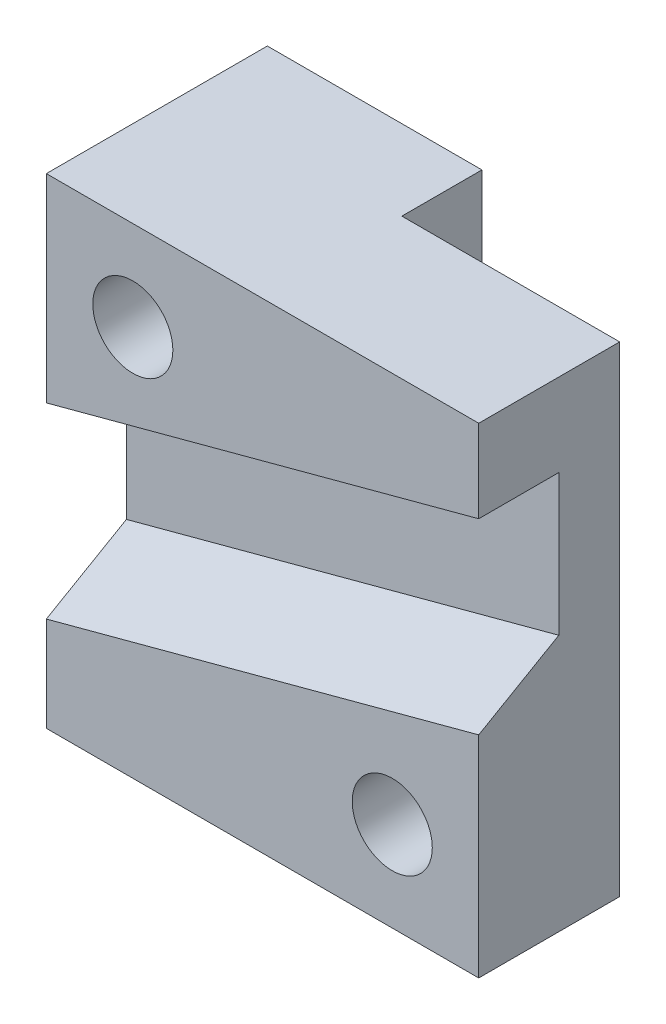
ISO-10303-21;
HEADER;
FILE_DESCRIPTION(('STEP AP214'),'2;1');
FILE_NAME('part.step','',(''),(''),'','','');
FILE_SCHEMA(('AUTOMOTIVE_DESIGN { 1 0 10303 214 1 1 1 1 }'));
ENDSEC;
DATA;
#1=APPLICATION_CONTEXT('core data for automotive mechanical design processes');
#2=APPLICATION_PROTOCOL_DEFINITION('international standard','automotive_design',2000,#1);
#3=PRODUCT_CONTEXT('',#1,'mechanical');
#4=PRODUCT('Part','Part','',(#3));
#5=PRODUCT_RELATED_PRODUCT_CATEGORY('part','',(#4));
#6=PRODUCT_DEFINITION_FORMATION('','',#4);
#7=PRODUCT_DEFINITION_CONTEXT('part definition',#1,'design');
#8=PRODUCT_DEFINITION('design','',#6,#7);
#9=PRODUCT_DEFINITION_SHAPE('','',#8);
#10=(LENGTH_UNIT() NAMED_UNIT(*) SI_UNIT(.MILLI.,.METRE.));
#11=(NAMED_UNIT(*) PLANE_ANGLE_UNIT() SI_UNIT($,.RADIAN.));
#12=(NAMED_UNIT(*) SI_UNIT($,.STERADIAN.) SOLID_ANGLE_UNIT());
#13=UNCERTAINTY_MEASURE_WITH_UNIT(LENGTH_MEASURE(1.E-05),#10,'distance_accuracy_value','');
#14=(GEOMETRIC_REPRESENTATION_CONTEXT(3) GLOBAL_UNCERTAINTY_ASSIGNED_CONTEXT((#13)) GLOBAL_UNIT_ASSIGNED_CONTEXT((#10,
#11,#12)) REPRESENTATION_CONTEXT('',''));
#15=CARTESIAN_POINT('',(0.,0.,0.));
#16=DIRECTION('',(0.,0.,1.));
#17=DIRECTION('',(1.,0.,0.));
#18=AXIS2_PLACEMENT_3D('',#15,#16,#17);
#19=CARTESIAN_POINT('',(0.,76.2,22.352));
#20=DIRECTION('',(0.,0.,-1.));
#21=DIRECTION('',(-1.,0.,0.));
#22=AXIS2_PLACEMENT_3D('',#19,#20,#21);
#23=PLANE('',#22);
#24=CARTESIAN_POINT('',(-13.716,14.224,22.352));
#25=DIRECTION('',(0.,0.,1.));
#26=DIRECTION('',(1.,0.,0.));
#27=AXIS2_PLACEMENT_3D('',#24,#25,#26);
#28=CIRCLE('',#27,6.35);
#29=CARTESIAN_POINT('',(-7.366,14.224,22.352));
#30=VERTEX_POINT('',#29);
#31=EDGE_CURVE('E231',#30,#30,#28,.T.);
#32=ORIENTED_EDGE('',*,*,#31,.F.);
#33=EDGE_LOOP('',(#32));
#34=FACE_BOUND('',#33,.T.);
#35=DIRECTION('',(0.,-1.,0.));
#36=VECTOR('',#35,1.);
#37=CARTESIAN_POINT('',(0.,76.2,22.352));
#38=LINE('',#37,#36);
#39=CARTESIAN_POINT('',(0.,33.3956071982183,22.352));
#40=VERTEX_POINT('',#39);
#41=CARTESIAN_POINT('',(0.,0.,22.352));
#42=VERTEX_POINT('',#41);
#43=EDGE_CURVE('E152',#40,#42,#38,.T.);
#44=ORIENTED_EDGE('',*,*,#43,.F.);
#45=DIRECTION('',(-0.965925826289068,-0.258819045102522,0.));
#46=VECTOR('',#45,1.);
#47=CARTESIAN_POINT('',(31.7369261955866,41.8994909425719,22.352));
#48=LINE('',#47,#46);
#49=CARTESIAN_POINT('',(-68.58,15.0196515812918,22.352));
#50=VERTEX_POINT('',#49);
#51=EDGE_CURVE('E175',#40,#50,#48,.T.);
#52=ORIENTED_EDGE('',*,*,#51,.T.);
#53=DIRECTION('',(0.,-1.,0.));
#54=VECTOR('',#53,1.);
#55=CARTESIAN_POINT('',(-68.58,76.2,22.352));
#56=LINE('',#55,#54);
#57=CARTESIAN_POINT('',(-68.58,0.,22.352));
#58=VERTEX_POINT('',#57);
#59=EDGE_CURVE('E125',#50,#58,#56,.T.);
#60=ORIENTED_EDGE('',*,*,#59,.T.);
#61=DIRECTION('',(1.,0.,0.));
#62=VECTOR('',#61,1.);
#63=CARTESIAN_POINT('',(0.,0.,22.352));
#64=LINE('',#63,#62);
#65=EDGE_CURVE('E146',#58,#42,#64,.T.);
#66=ORIENTED_EDGE('',*,*,#65,.T.);
#67=EDGE_LOOP('',(#44,#52,#60,#66));
#68=FACE_BOUND('',#67,.T.);
#69=ADVANCED_FACE('F33',(#34,#68),#23,.F.);
#70=CARTESIAN_POINT('',(-34.544,76.2,0.));
#71=DIRECTION('',(0.,0.,1.));
#72=DIRECTION('',(1.,0.,0.));
#73=AXIS2_PLACEMENT_3D('',#70,#71,#72);
#74=PLANE('',#73);
#75=CARTESIAN_POINT('',(-13.716,14.224,0.));
#76=DIRECTION('',(0.,0.,1.));
#77=DIRECTION('',(1.,0.,0.));
#78=AXIS2_PLACEMENT_3D('',#75,#76,#77);
#79=CIRCLE('',#78,6.35);
#80=CARTESIAN_POINT('',(-7.366,14.224,0.));
#81=VERTEX_POINT('',#80);
#82=EDGE_CURVE('E37',#81,#81,#79,.T.);
#83=ORIENTED_EDGE('',*,*,#82,.T.);
#84=EDGE_LOOP('',(#83));
#85=FACE_BOUND('',#84,.T.);
#86=DIRECTION('',(-1.,0.,0.));
#87=VECTOR('',#86,1.);
#88=CARTESIAN_POINT('',(-34.544,0.,0.));
#89=LINE('',#88,#87);
#90=CARTESIAN_POINT('',(0.,0.,0.));
#91=VERTEX_POINT('',#90);
#92=CARTESIAN_POINT('',(-34.544,0.,0.));
#93=VERTEX_POINT('',#92);
#94=EDGE_CURVE('E135',#91,#93,#89,.T.);
#95=ORIENTED_EDGE('',*,*,#94,.T.);
#96=DIRECTION('',(0.,-1.,0.));
#97=VECTOR('',#96,1.);
#98=CARTESIAN_POINT('',(-34.544,76.2,0.));
#99=LINE('',#98,#97);
#100=CARTESIAN_POINT('',(-34.544,76.2,0.));
#101=VERTEX_POINT('',#100);
#102=EDGE_CURVE('E11',#101,#93,#99,.T.);
#103=ORIENTED_EDGE('',*,*,#102,.F.);
#104=DIRECTION('',(-1.,0.,0.));
#105=VECTOR('',#104,1.);
#106=CARTESIAN_POINT('',(-34.544,76.2,0.));
#107=LINE('',#106,#105);
#108=CARTESIAN_POINT('',(0.,76.2,0.));
#109=VERTEX_POINT('',#108);
#110=EDGE_CURVE('E150',#109,#101,#107,.T.);
#111=ORIENTED_EDGE('',*,*,#110,.F.);
#112=DIRECTION('',(0.,-1.,0.));
#113=VECTOR('',#112,1.);
#114=CARTESIAN_POINT('',(0.,76.2,0.));
#115=LINE('',#114,#113);
#116=EDGE_CURVE('E131',#109,#91,#115,.T.);
#117=ORIENTED_EDGE('',*,*,#116,.T.);
#118=EDGE_LOOP('',(#95,#103,#111,#117));
#119=FACE_BOUND('',#118,.T.);
#120=ADVANCED_FACE('F35',(#85,#119),#74,.F.);
#121=CARTESIAN_POINT('',(-34.544,76.2,-12.7));
#122=DIRECTION('',(-1.,0.,0.));
#123=DIRECTION('',(0.,0.,1.));
#124=AXIS2_PLACEMENT_3D('',#121,#122,#123);
#125=PLANE('',#124);
#126=DIRECTION('',(0.,0.,-1.));
#127=VECTOR('',#126,1.);
#128=CARTESIAN_POINT('',(-34.544,0.,-12.7));
#129=LINE('',#128,#127);
#130=CARTESIAN_POINT('',(-34.544,0.,-12.7));
#131=VERTEX_POINT('',#130);
#132=EDGE_CURVE('E138',#93,#131,#129,.T.);
#133=ORIENTED_EDGE('',*,*,#132,.T.);
#134=DIRECTION('',(0.,-1.,0.));
#135=VECTOR('',#134,1.);
#136=CARTESIAN_POINT('',(-34.544,76.2,-12.7));
#137=LINE('',#136,#135);
#138=CARTESIAN_POINT('',(-34.544,76.2,-12.7));
#139=VERTEX_POINT('',#138);
#140=EDGE_CURVE('E42',#139,#131,#137,.T.);
#141=ORIENTED_EDGE('',*,*,#140,.F.);
#142=DIRECTION('',(0.,0.,-1.));
#143=VECTOR('',#142,1.);
#144=CARTESIAN_POINT('',(-34.544,76.2,-12.7));
#145=LINE('',#144,#143);
#146=EDGE_CURVE('E92',#101,#139,#145,.T.);
#147=ORIENTED_EDGE('',*,*,#146,.F.);
#148=ORIENTED_EDGE('',*,*,#102,.T.);
#149=EDGE_LOOP('',(#133,#141,#147,#148));
#150=FACE_BOUND('',#149,.T.);
#151=ADVANCED_FACE('F198',(#150),#125,.F.);
#152=CARTESIAN_POINT('',(-68.58,76.2,-12.7));
#153=DIRECTION('',(0.,0.,1.));
#154=DIRECTION('',(1.,0.,0.));
#155=AXIS2_PLACEMENT_3D('',#152,#153,#154);
#156=PLANE('',#155);
#157=CARTESIAN_POINT('',(-54.864,61.976,-12.7));
#158=DIRECTION('',(0.,0.,1.));
#159=DIRECTION('',(1.,0.,0.));
#160=AXIS2_PLACEMENT_3D('',#157,#158,#159);
#161=CIRCLE('',#160,6.35);
#162=CARTESIAN_POINT('',(-48.514,61.976,-12.7));
#163=VERTEX_POINT('',#162);
#164=EDGE_CURVE('E226',#163,#163,#161,.T.);
#165=ORIENTED_EDGE('',*,*,#164,.T.);
#166=EDGE_LOOP('',(#165));
#167=FACE_BOUND('',#166,.T.);
#168=DIRECTION('',(-1.,0.,0.));
#169=VECTOR('',#168,1.);
#170=CARTESIAN_POINT('',(-68.58,0.,-12.7));
#171=LINE('',#170,#169);
#172=CARTESIAN_POINT('',(-68.58,0.,-12.7));
#173=VERTEX_POINT('',#172);
#174=EDGE_CURVE('E141',#131,#173,#171,.T.);
#175=ORIENTED_EDGE('',*,*,#174,.T.);
#176=DIRECTION('',(0.,-1.,0.));
#177=VECTOR('',#176,1.);
#178=CARTESIAN_POINT('',(-68.58,76.2,-12.7));
#179=LINE('',#178,#177);
#180=CARTESIAN_POINT('',(-68.58,76.2,-12.7));
#181=VERTEX_POINT('',#180);
#182=EDGE_CURVE('E124',#181,#173,#179,.T.);
#183=ORIENTED_EDGE('',*,*,#182,.F.);
#184=DIRECTION('',(-1.,0.,0.));
#185=VECTOR('',#184,1.);
#186=CARTESIAN_POINT('',(-68.58,76.2,-12.7));
#187=LINE('',#186,#185);
#188=EDGE_CURVE('E109',#139,#181,#187,.T.);
#189=ORIENTED_EDGE('',*,*,#188,.F.);
#190=ORIENTED_EDGE('',*,*,#140,.T.);
#191=EDGE_LOOP('',(#175,#183,#189,#190));
#192=FACE_BOUND('',#191,.T.);
#193=ADVANCED_FACE('F158',(#167,#192),#156,.F.);
#194=CARTESIAN_POINT('',(-68.58,76.2,22.352));
#195=DIRECTION('',(1.,0.,0.));
#196=DIRECTION('',(0.,0.,-1.));
#197=AXIS2_PLACEMENT_3D('',#194,#195,#196);
#198=PLANE('',#197);
#199=ORIENTED_EDGE('',*,*,#59,.F.);
#200=DIRECTION('',(0.,-0.499999999999997,0.86602540378444));
#201=VECTOR('',#200,1.);
#202=CARTESIAN_POINT('',(-68.58,22.352,9.65200000000002));
#203=LINE('',#202,#201);
#204=CARTESIAN_POINT('',(-68.58,22.352,9.65200000000002));
#205=VERTEX_POINT('',#204);
#206=EDGE_CURVE('E168',#205,#50,#203,.T.);
#207=ORIENTED_EDGE('',*,*,#206,.F.);
#208=DIRECTION('',(0.,-1.,0.));
#209=VECTOR('',#208,1.);
#210=CARTESIAN_POINT('',(-68.58,44.704,9.65200000000001));
#211=LINE('',#210,#209);
#212=CARTESIAN_POINT('',(-68.58,44.704,9.65200000000001));
#213=VERTEX_POINT('',#212);
#214=EDGE_CURVE('E235',#213,#205,#211,.T.);
#215=ORIENTED_EDGE('',*,*,#214,.F.);
#216=DIRECTION('',(0.,0.,-1.));
#217=VECTOR('',#216,1.);
#218=CARTESIAN_POINT('',(-68.58,44.704,22.352));
#219=LINE('',#218,#217);
#220=CARTESIAN_POINT('',(-68.58,44.704,22.352));
#221=VERTEX_POINT('',#220);
#222=EDGE_CURVE('E121',#221,#213,#219,.T.);
#223=ORIENTED_EDGE('',*,*,#222,.F.);
#224=CARTESIAN_POINT('',(-68.58,76.2,22.352));
#225=VERTEX_POINT('',#224);
#226=EDGE_CURVE('E116',#225,#221,#56,.T.);
#227=ORIENTED_EDGE('',*,*,#226,.F.);
#228=DIRECTION('',(0.,0.,1.));
#229=VECTOR('',#228,1.);
#230=CARTESIAN_POINT('',(-68.58,76.2,22.352));
#231=LINE('',#230,#229);
#232=EDGE_CURVE('E102',#181,#225,#231,.T.);
#233=ORIENTED_EDGE('',*,*,#232,.F.);
#234=ORIENTED_EDGE('',*,*,#182,.T.);
#235=DIRECTION('',(0.,0.,1.));
#236=VECTOR('',#235,1.);
#237=CARTESIAN_POINT('',(-68.58,0.,22.352));
#238=LINE('',#237,#236);
#239=EDGE_CURVE('E143',#173,#58,#238,.T.);
#240=ORIENTED_EDGE('',*,*,#239,.T.);
#241=EDGE_LOOP('',(#199,#207,#215,#223,#227,#233,#234,#240));
#242=FACE_BOUND('',#241,.T.);
#243=ADVANCED_FACE('F118',(#242),#198,.F.);
#244=CARTESIAN_POINT('',(-54.864,61.976,22.352));
#245=DIRECTION('',(0.,0.,1.));
#246=DIRECTION('',(1.,0.,0.));
#247=AXIS2_PLACEMENT_3D('',#244,#245,#246);
#248=CIRCLE('',#247,6.35);
#249=CARTESIAN_POINT('',(-48.514,61.976,22.352));
#250=VERTEX_POINT('',#249);
#251=EDGE_CURVE('E224',#250,#250,#248,.T.);
#252=ORIENTED_EDGE('',*,*,#251,.F.);
#253=EDGE_LOOP('',(#252));
#254=FACE_BOUND('',#253,.T.);
#255=ORIENTED_EDGE('',*,*,#226,.T.);
#256=DIRECTION('',(-0.965925826289068,-0.258819045102522,0.));
#257=VECTOR('',#256,1.);
#258=CARTESIAN_POINT('',(31.7369261955866,71.5838393612801,22.352));
#259=LINE('',#258,#257);
#260=CARTESIAN_POINT('',(0.,63.0799556169265,22.352));
#261=VERTEX_POINT('',#260);
#262=EDGE_CURVE('E190',#261,#221,#259,.T.);
#263=ORIENTED_EDGE('',*,*,#262,.F.);
#264=CARTESIAN_POINT('',(0.,76.2,22.352));
#265=VERTEX_POINT('',#264);
#266=EDGE_CURVE('E129',#265,#261,#38,.T.);
#267=ORIENTED_EDGE('',*,*,#266,.F.);
#268=DIRECTION('',(1.,0.,0.));
#269=VECTOR('',#268,1.);
#270=CARTESIAN_POINT('',(0.,76.2,22.352));
#271=LINE('',#270,#269);
#272=EDGE_CURVE('E106',#225,#265,#271,.T.);
#273=ORIENTED_EDGE('',*,*,#272,.F.);
#274=EDGE_LOOP('',(#255,#263,#267,#273));
#275=FACE_BOUND('',#274,.T.);
#276=ADVANCED_FACE('F127',(#254,#275),#23,.F.);
#277=CARTESIAN_POINT('',(0.,76.2,0.));
#278=DIRECTION('',(-1.,0.,0.));
#279=DIRECTION('',(0.,0.,1.));
#280=AXIS2_PLACEMENT_3D('',#277,#278,#279);
#281=PLANE('',#280);
#282=DIRECTION('',(0.,1.,0.));
#283=VECTOR('',#282,1.);
#284=CARTESIAN_POINT('',(0.,71.5838393612801,9.65200000000001));
#285=LINE('',#284,#283);
#286=CARTESIAN_POINT('',(0.,40.7279556169265,9.65200000000002));
#287=VERTEX_POINT('',#286);
#288=CARTESIAN_POINT('',(0.,63.0799556169265,9.65200000000001));
#289=VERTEX_POINT('',#288);
#290=EDGE_CURVE('E179',#287,#289,#285,.T.);
#291=ORIENTED_EDGE('',*,*,#290,.F.);
#292=DIRECTION('',(0.,0.499999999999997,-0.86602540378444));
#293=VECTOR('',#292,1.);
#294=CARTESIAN_POINT('',(0.,42.8539265530148,5.96971032328016));
#295=LINE('',#294,#293);
#296=EDGE_CURVE('E182',#40,#287,#295,.T.);
#297=ORIENTED_EDGE('',*,*,#296,.F.);
#298=ORIENTED_EDGE('',*,*,#43,.T.);
#299=DIRECTION('',(0.,0.,-1.));
#300=VECTOR('',#299,1.);
#301=CARTESIAN_POINT('',(0.,0.,0.));
#302=LINE('',#301,#300);
#303=EDGE_CURVE('E84',#42,#91,#302,.T.);
#304=ORIENTED_EDGE('',*,*,#303,.T.);
#305=ORIENTED_EDGE('',*,*,#116,.F.);
#306=DIRECTION('',(0.,0.,-1.));
#307=VECTOR('',#306,1.);
#308=CARTESIAN_POINT('',(0.,76.2,0.));
#309=LINE('',#308,#307);
#310=EDGE_CURVE('E58',#265,#109,#309,.T.);
#311=ORIENTED_EDGE('',*,*,#310,.F.);
#312=ORIENTED_EDGE('',*,*,#266,.T.);
#313=DIRECTION('',(0.,0.,1.));
#314=VECTOR('',#313,1.);
#315=CARTESIAN_POINT('',(0.,63.0799556169265,22.352));
#316=LINE('',#315,#314);
#317=EDGE_CURVE('E139',#289,#261,#316,.T.);
#318=ORIENTED_EDGE('',*,*,#317,.F.);
#319=EDGE_LOOP('',(#291,#297,#298,#304,#305,#311,#312,#318));
#320=FACE_BOUND('',#319,.T.);
#321=ADVANCED_FACE('F216',(#320),#281,.F.);
#322=CARTESIAN_POINT('',(0.,76.2,0.));
#323=DIRECTION('',(0.,-1.,0.));
#324=DIRECTION('',(0.,0.,-1.));
#325=AXIS2_PLACEMENT_3D('',#322,#323,#324);
#326=PLANE('',#325);
#327=ORIENTED_EDGE('',*,*,#110,.T.);
#328=ORIENTED_EDGE('',*,*,#146,.T.);
#329=ORIENTED_EDGE('',*,*,#188,.T.);
#330=ORIENTED_EDGE('',*,*,#232,.T.);
#331=ORIENTED_EDGE('',*,*,#272,.T.);
#332=ORIENTED_EDGE('',*,*,#310,.T.);
#333=EDGE_LOOP('',(#327,#328,#329,#330,#331,#332));
#334=FACE_BOUND('',#333,.T.);
#335=ADVANCED_FACE('F104',(#334),#326,.F.);
#336=CARTESIAN_POINT('',(0.,0.,0.));
#337=DIRECTION('',(0.,-1.,0.));
#338=DIRECTION('',(0.,0.,-1.));
#339=AXIS2_PLACEMENT_3D('',#336,#337,#338);
#340=PLANE('',#339);
#341=ORIENTED_EDGE('',*,*,#94,.F.);
#342=ORIENTED_EDGE('',*,*,#303,.F.);
#343=ORIENTED_EDGE('',*,*,#65,.F.);
#344=ORIENTED_EDGE('',*,*,#239,.F.);
#345=ORIENTED_EDGE('',*,*,#174,.F.);
#346=ORIENTED_EDGE('',*,*,#132,.F.);
#347=EDGE_LOOP('',(#341,#342,#343,#344,#345,#346));
#348=FACE_BOUND('',#347,.T.);
#349=ADVANCED_FACE('F162',(#348),#340,.T.);
#350=CARTESIAN_POINT('',(31.7369261955866,49.2318393612801,9.65200000000002));
#351=DIRECTION('',(0.226044624379457,-0.843610022961952,-0.487058473848146));
#352=DIRECTION('',(0.,0.499999999999997,-0.86602540378444));
#353=AXIS2_PLACEMENT_3D('',#350,#351,#352);
#354=PLANE('',#353);
#355=ORIENTED_EDGE('',*,*,#296,.T.);
#356=DIRECTION('',(-0.965925826289068,-0.258819045102522,0.));
#357=VECTOR('',#356,1.);
#358=CARTESIAN_POINT('',(31.7369261955866,49.2318393612801,9.65200000000002));
#359=LINE('',#358,#357);
#360=EDGE_CURVE('E180',#287,#205,#359,.T.);
#361=ORIENTED_EDGE('',*,*,#360,.T.);
#362=ORIENTED_EDGE('',*,*,#206,.T.);
#363=ORIENTED_EDGE('',*,*,#51,.F.);
#364=EDGE_LOOP('',(#355,#361,#362,#363));
#365=FACE_BOUND('',#364,.T.);
#366=ADVANCED_FACE('F239',(#365),#354,.F.);
#367=CARTESIAN_POINT('',(31.7369261955866,71.5838393612801,9.65200000000001));
#368=DIRECTION('',(0.,0.,-1.));
#369=DIRECTION('',(0.,1.,0.));
#370=AXIS2_PLACEMENT_3D('',#367,#368,#369);
#371=PLANE('',#370);
#372=ORIENTED_EDGE('',*,*,#290,.T.);
#373=DIRECTION('',(-0.965925826289068,-0.258819045102522,0.));
#374=VECTOR('',#373,1.);
#375=CARTESIAN_POINT('',(31.7369261955866,71.5838393612801,9.65200000000001));
#376=LINE('',#375,#374);
#377=EDGE_CURVE('E49',#289,#213,#376,.T.);
#378=ORIENTED_EDGE('',*,*,#377,.T.);
#379=ORIENTED_EDGE('',*,*,#214,.T.);
#380=ORIENTED_EDGE('',*,*,#360,.F.);
#381=EDGE_LOOP('',(#372,#378,#379,#380));
#382=FACE_BOUND('',#381,.T.);
#383=ADVANCED_FACE('F243',(#382),#371,.F.);
#384=CARTESIAN_POINT('',(31.7369261955866,71.5838393612801,22.352));
#385=DIRECTION('',(-0.258819045102522,0.965925826289068,0.));
#386=DIRECTION('',(-0.965925826289068,-0.258819045102522,0.));
#387=AXIS2_PLACEMENT_3D('',#384,#385,#386);
#388=PLANE('',#387);
#389=ORIENTED_EDGE('',*,*,#317,.T.);
#390=ORIENTED_EDGE('',*,*,#262,.T.);
#391=ORIENTED_EDGE('',*,*,#222,.T.);
#392=ORIENTED_EDGE('',*,*,#377,.F.);
#393=EDGE_LOOP('',(#389,#390,#391,#392));
#394=FACE_BOUND('',#393,.T.);
#395=ADVANCED_FACE('F245',(#394),#388,.F.);
#396=CARTESIAN_POINT('',(-54.864,61.976,-12.7));
#397=DIRECTION('',(0.,0.,1.));
#398=DIRECTION('',(1.,0.,0.));
#399=AXIS2_PLACEMENT_3D('',#396,#397,#398);
#400=CYLINDRICAL_SURFACE('',#399,6.35);
#401=ORIENTED_EDGE('',*,*,#164,.F.);
#402=EDGE_LOOP('',(#401));
#403=FACE_BOUND('',#402,.T.);
#404=ORIENTED_EDGE('',*,*,#251,.T.);
#405=EDGE_LOOP('',(#404));
#406=FACE_BOUND('',#405,.T.);
#407=ADVANCED_FACE('F250',(#403,#406),#400,.F.);
#408=CARTESIAN_POINT('',(-13.716,14.224,-12.7));
#409=DIRECTION('',(0.,0.,1.));
#410=DIRECTION('',(1.,0.,0.));
#411=AXIS2_PLACEMENT_3D('',#408,#409,#410);
#412=CYLINDRICAL_SURFACE('',#411,6.35);
#413=ORIENTED_EDGE('',*,*,#31,.T.);
#414=EDGE_LOOP('',(#413));
#415=FACE_BOUND('',#414,.T.);
#416=ORIENTED_EDGE('',*,*,#82,.F.);
#417=EDGE_LOOP('',(#416));
#418=FACE_BOUND('',#417,.T.);
#419=ADVANCED_FACE('F256',(#415,#418),#412,.F.);
#420=CLOSED_SHELL('',(#69,#120,#151,#193,#243,#276,#321,#335,#349,#366,#383,#395,#407,#419));
#421=MANIFOLD_SOLID_BREP('B2',#420);
#422=ADVANCED_BREP_SHAPE_REPRESENTATION('',(#18,#421),#14);
#423=SHAPE_DEFINITION_REPRESENTATION(#9,#422);
ENDSEC;
END-ISO-10303-21;
